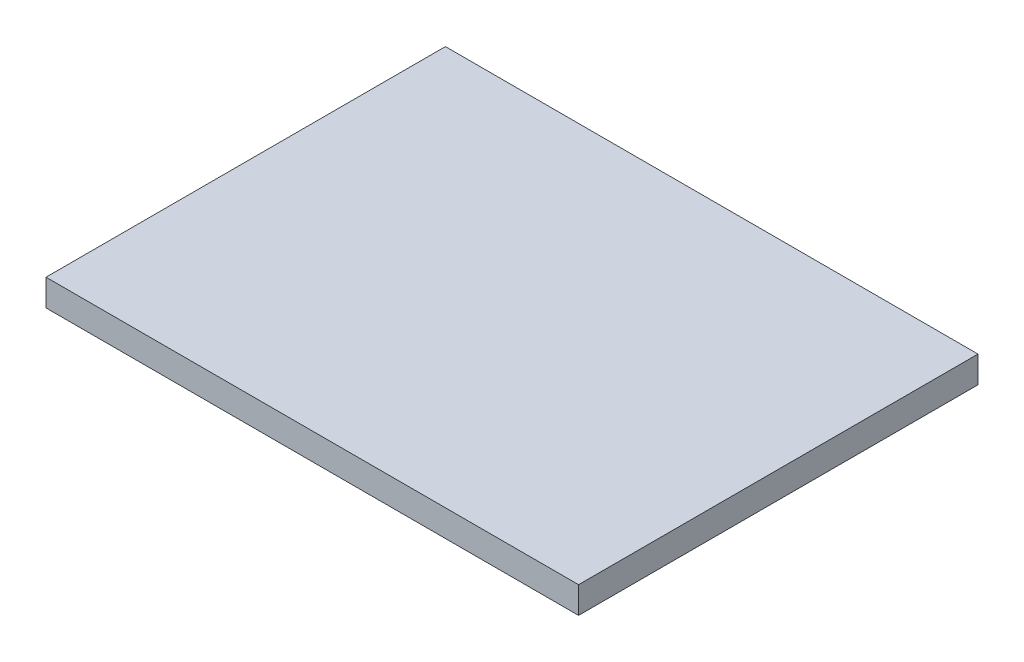
ISO-10303-21;
HEADER;
FILE_DESCRIPTION(('STEP AP214'),'2;1');
FILE_NAME('part.step','',(''),(''),'','','');
FILE_SCHEMA(('AUTOMOTIVE_DESIGN { 1 0 10303 214 1 1 1 1 }'));
ENDSEC;
DATA;
#1=APPLICATION_CONTEXT('core data for automotive mechanical design processes');
#2=APPLICATION_PROTOCOL_DEFINITION('international standard','automotive_design',2000,#1);
#3=PRODUCT_CONTEXT('',#1,'mechanical');
#4=PRODUCT('Part','Part','',(#3));
#5=PRODUCT_RELATED_PRODUCT_CATEGORY('part','',(#4));
#6=PRODUCT_DEFINITION_FORMATION('','',#4);
#7=PRODUCT_DEFINITION_CONTEXT('part definition',#1,'design');
#8=PRODUCT_DEFINITION('design','',#6,#7);
#9=PRODUCT_DEFINITION_SHAPE('','',#8);
#10=(LENGTH_UNIT() NAMED_UNIT(*) SI_UNIT(.MILLI.,.METRE.));
#11=(NAMED_UNIT(*) PLANE_ANGLE_UNIT() SI_UNIT($,.RADIAN.));
#12=(NAMED_UNIT(*) SI_UNIT($,.STERADIAN.) SOLID_ANGLE_UNIT());
#13=UNCERTAINTY_MEASURE_WITH_UNIT(LENGTH_MEASURE(1.E-05),#10,'distance_accuracy_value','');
#14=(GEOMETRIC_REPRESENTATION_CONTEXT(3) GLOBAL_UNCERTAINTY_ASSIGNED_CONTEXT((#13)) GLOBAL_UNIT_ASSIGNED_CONTEXT((#10,
#11,#12)) REPRESENTATION_CONTEXT('',''));
#15=CARTESIAN_POINT('',(0.,0.,0.));
#16=DIRECTION('',(0.,0.,1.));
#17=DIRECTION('',(1.,0.,0.));
#18=AXIS2_PLACEMENT_3D('',#15,#16,#17);
#19=CARTESIAN_POINT('',(-6.80918519396791,2.54,-47.0936395018953));
#20=DIRECTION('',(-1.,0.,0.));
#21=DIRECTION('',(0.,0.,1.));
#22=AXIS2_PLACEMENT_3D('',#19,#20,#21);
#23=PLANE('',#22);
#24=DIRECTION('',(0.,0.,-1.));
#25=VECTOR('',#24,1.);
#26=CARTESIAN_POINT('',(-6.80918519396791,0.,-47.0936395018953));
#27=LINE('',#26,#25);
#28=CARTESIAN_POINT('',(-6.8091851939679,0.,-8.99363950189527));
#29=VERTEX_POINT('',#28);
#30=CARTESIAN_POINT('',(-6.80918519396791,0.,-47.0936395018953));
#31=VERTEX_POINT('',#30);
#32=EDGE_CURVE('E96',#29,#31,#27,.T.);
#33=ORIENTED_EDGE('',*,*,#32,.T.);
#34=DIRECTION('',(0.,-1.,0.));
#35=VECTOR('',#34,1.);
#36=CARTESIAN_POINT('',(-6.80918519396791,2.54,-47.0936395018953));
#37=LINE('',#36,#35);
#38=CARTESIAN_POINT('',(-6.80918519396791,2.54,-47.0936395018953));
#39=VERTEX_POINT('',#38);
#40=EDGE_CURVE('E11',#39,#31,#37,.T.);
#41=ORIENTED_EDGE('',*,*,#40,.F.);
#42=DIRECTION('',(0.,0.,-1.));
#43=VECTOR('',#42,1.);
#44=CARTESIAN_POINT('',(-6.80918519396791,2.54,-47.0936395018953));
#45=LINE('',#44,#43);
#46=CARTESIAN_POINT('',(-6.8091851939679,2.54,-8.99363950189527));
#47=VERTEX_POINT('',#46);
#48=EDGE_CURVE('E84',#47,#39,#45,.T.);
#49=ORIENTED_EDGE('',*,*,#48,.F.);
#50=DIRECTION('',(0.,-1.,0.));
#51=VECTOR('',#50,1.);
#52=CARTESIAN_POINT('',(-6.8091851939679,2.54,-8.99363950189527));
#53=LINE('',#52,#51);
#54=EDGE_CURVE('E92',#47,#29,#53,.T.);
#55=ORIENTED_EDGE('',*,*,#54,.T.);
#56=EDGE_LOOP('',(#33,#41,#49,#55));
#57=FACE_BOUND('',#56,.T.);
#58=ADVANCED_FACE('F33',(#57),#23,.F.);
#59=CARTESIAN_POINT('',(-57.6091851939679,2.54,-47.0936395018953));
#60=DIRECTION('',(0.,0.,1.));
#61=DIRECTION('',(1.,0.,0.));
#62=AXIS2_PLACEMENT_3D('',#59,#60,#61);
#63=PLANE('',#62);
#64=DIRECTION('',(-1.,0.,0.));
#65=VECTOR('',#64,1.);
#66=CARTESIAN_POINT('',(-57.6091851939679,0.,-47.0936395018953));
#67=LINE('',#66,#65);
#68=CARTESIAN_POINT('',(-57.6091851939679,0.,-47.0936395018953));
#69=VERTEX_POINT('',#68);
#70=EDGE_CURVE('E88',#31,#69,#67,.T.);
#71=ORIENTED_EDGE('',*,*,#70,.T.);
#72=DIRECTION('',(0.,-1.,0.));
#73=VECTOR('',#72,1.);
#74=CARTESIAN_POINT('',(-57.6091851939679,2.54,-47.0936395018953));
#75=LINE('',#74,#73);
#76=CARTESIAN_POINT('',(-57.6091851939679,2.54,-47.0936395018953));
#77=VERTEX_POINT('',#76);
#78=EDGE_CURVE('E41',#77,#69,#75,.T.);
#79=ORIENTED_EDGE('',*,*,#78,.F.);
#80=DIRECTION('',(-1.,0.,0.));
#81=VECTOR('',#80,1.);
#82=CARTESIAN_POINT('',(-57.6091851939679,2.54,-47.0936395018953));
#83=LINE('',#82,#81);
#84=EDGE_CURVE('E79',#39,#77,#83,.T.);
#85=ORIENTED_EDGE('',*,*,#84,.F.);
#86=ORIENTED_EDGE('',*,*,#40,.T.);
#87=EDGE_LOOP('',(#71,#79,#85,#86));
#88=FACE_BOUND('',#87,.T.);
#89=ADVANCED_FACE('F87',(#88),#63,.F.);
#90=CARTESIAN_POINT('',(-57.6091851939679,2.54,-47.0936395018953));
#91=DIRECTION('',(1.,0.,0.));
#92=DIRECTION('',(0.,0.,-1.));
#93=AXIS2_PLACEMENT_3D('',#90,#91,#92);
#94=PLANE('',#93);
#95=DIRECTION('',(0.,0.,1.));
#96=VECTOR('',#95,1.);
#97=CARTESIAN_POINT('',(-57.6091851939679,0.,-47.0936395018953));
#98=LINE('',#97,#96);
#99=CARTESIAN_POINT('',(-57.6091851939679,0.,-8.99363950189527));
#100=VERTEX_POINT('',#99);
#101=EDGE_CURVE('E66',#69,#100,#98,.T.);
#102=ORIENTED_EDGE('',*,*,#101,.T.);
#103=DIRECTION('',(0.,-1.,0.));
#104=VECTOR('',#103,1.);
#105=CARTESIAN_POINT('',(-57.6091851939679,2.54,-8.99363950189527));
#106=LINE('',#105,#104);
#107=CARTESIAN_POINT('',(-57.6091851939679,2.54,-8.99363950189527));
#108=VERTEX_POINT('',#107);
#109=EDGE_CURVE('E89',#108,#100,#106,.T.);
#110=ORIENTED_EDGE('',*,*,#109,.F.);
#111=DIRECTION('',(0.,0.,1.));
#112=VECTOR('',#111,1.);
#113=CARTESIAN_POINT('',(-57.6091851939679,2.54,-47.0936395018953));
#114=LINE('',#113,#112);
#115=EDGE_CURVE('E82',#77,#108,#114,.T.);
#116=ORIENTED_EDGE('',*,*,#115,.F.);
#117=ORIENTED_EDGE('',*,*,#78,.T.);
#118=EDGE_LOOP('',(#102,#110,#116,#117));
#119=FACE_BOUND('',#118,.T.);
#120=ADVANCED_FACE('F90',(#119),#94,.F.);
#121=CARTESIAN_POINT('',(-57.6091851939679,2.54,-8.99363950189527));
#122=DIRECTION('',(0.,0.,-1.));
#123=DIRECTION('',(-1.,0.,0.));
#124=AXIS2_PLACEMENT_3D('',#121,#122,#123);
#125=PLANE('',#124);
#126=DIRECTION('',(1.,0.,0.));
#127=VECTOR('',#126,1.);
#128=CARTESIAN_POINT('',(-57.6091851939679,0.,-8.99363950189527));
#129=LINE('',#128,#127);
#130=EDGE_CURVE('E72',#100,#29,#129,.T.);
#131=ORIENTED_EDGE('',*,*,#130,.T.);
#132=ORIENTED_EDGE('',*,*,#54,.F.);
#133=DIRECTION('',(1.,0.,0.));
#134=VECTOR('',#133,1.);
#135=CARTESIAN_POINT('',(-57.6091851939679,2.54,-8.99363950189527));
#136=LINE('',#135,#134);
#137=EDGE_CURVE('E49',#108,#47,#136,.T.);
#138=ORIENTED_EDGE('',*,*,#137,.F.);
#139=ORIENTED_EDGE('',*,*,#109,.T.);
#140=EDGE_LOOP('',(#131,#132,#138,#139));
#141=FACE_BOUND('',#140,.T.);
#142=ADVANCED_FACE('F103',(#141),#125,.F.);
#143=CARTESIAN_POINT('',(0.,2.54,0.));
#144=DIRECTION('',(0.,1.,0.));
#145=DIRECTION('',(0.,0.,1.));
#146=AXIS2_PLACEMENT_3D('',#143,#144,#145);
#147=PLANE('',#146);
#148=ORIENTED_EDGE('',*,*,#48,.T.);
#149=ORIENTED_EDGE('',*,*,#84,.T.);
#150=ORIENTED_EDGE('',*,*,#115,.T.);
#151=ORIENTED_EDGE('',*,*,#137,.T.);
#152=EDGE_LOOP('',(#148,#149,#150,#151));
#153=FACE_BOUND('',#152,.T.);
#154=ADVANCED_FACE('F80',(#153),#147,.T.);
#155=CARTESIAN_POINT('',(0.,0.,0.));
#156=DIRECTION('',(0.,1.,0.));
#157=DIRECTION('',(0.,0.,1.));
#158=AXIS2_PLACEMENT_3D('',#155,#156,#157);
#159=PLANE('',#158);
#160=ORIENTED_EDGE('',*,*,#32,.F.);
#161=ORIENTED_EDGE('',*,*,#130,.F.);
#162=ORIENTED_EDGE('',*,*,#101,.F.);
#163=ORIENTED_EDGE('',*,*,#70,.F.);
#164=EDGE_LOOP('',(#160,#161,#162,#163));
#165=FACE_BOUND('',#164,.T.);
#166=ADVANCED_FACE('F106',(#165),#159,.F.);
#167=CLOSED_SHELL('',(#58,#89,#120,#142,#154,#166));
#168=MANIFOLD_SOLID_BREP('B2',#167);
#169=ADVANCED_BREP_SHAPE_REPRESENTATION('',(#18,#168),#14);
#170=SHAPE_DEFINITION_REPRESENTATION(#9,#169);
ENDSEC;
END-ISO-10303-21;
